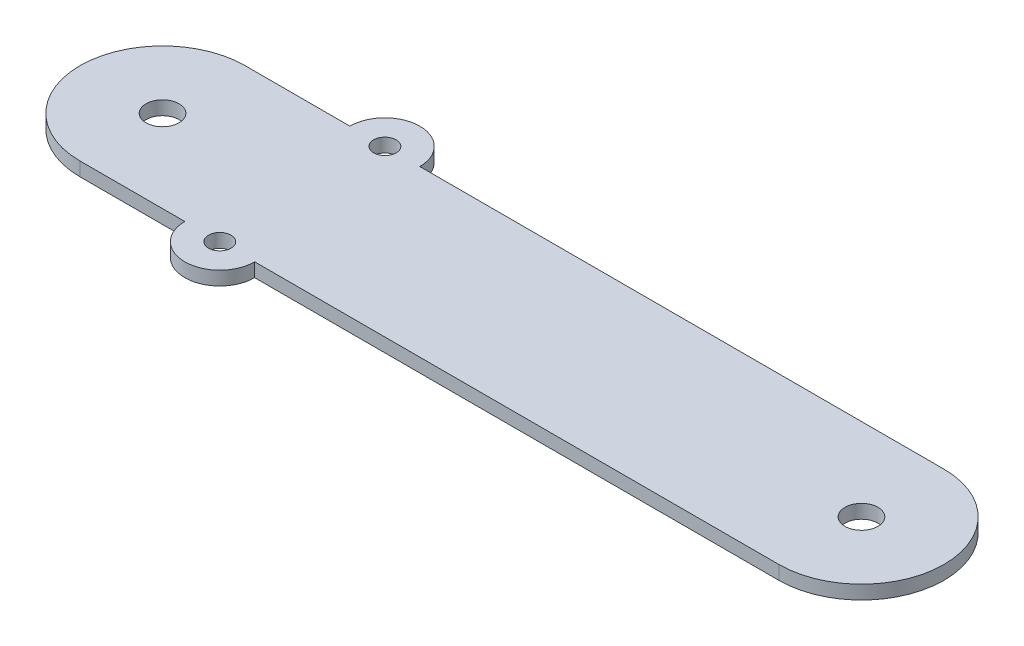
ISO-10303-21;
HEADER;
FILE_DESCRIPTION(('STEP AP214'),'2;1');
FILE_NAME('part.step','',(''),(''),'','','');
FILE_SCHEMA(('AUTOMOTIVE_DESIGN { 1 0 10303 214 1 1 1 1 }'));
ENDSEC;
DATA;
#1=APPLICATION_CONTEXT('core data for automotive mechanical design processes');
#2=APPLICATION_PROTOCOL_DEFINITION('international standard','automotive_design',2000,#1);
#3=PRODUCT_CONTEXT('',#1,'mechanical');
#4=PRODUCT('Part','Part','',(#3));
#5=PRODUCT_RELATED_PRODUCT_CATEGORY('part','',(#4));
#6=PRODUCT_DEFINITION_FORMATION('','',#4);
#7=PRODUCT_DEFINITION_CONTEXT('part definition',#1,'design');
#8=PRODUCT_DEFINITION('design','',#6,#7);
#9=PRODUCT_DEFINITION_SHAPE('','',#8);
#10=(LENGTH_UNIT() NAMED_UNIT(*) SI_UNIT(.MILLI.,.METRE.));
#11=(NAMED_UNIT(*) PLANE_ANGLE_UNIT() SI_UNIT($,.RADIAN.));
#12=(NAMED_UNIT(*) SI_UNIT($,.STERADIAN.) SOLID_ANGLE_UNIT());
#13=UNCERTAINTY_MEASURE_WITH_UNIT(LENGTH_MEASURE(1.E-05),#10,'distance_accuracy_value','');
#14=(GEOMETRIC_REPRESENTATION_CONTEXT(3) GLOBAL_UNCERTAINTY_ASSIGNED_CONTEXT((#13)) GLOBAL_UNIT_ASSIGNED_CONTEXT((#10,
#11,#12)) REPRESENTATION_CONTEXT('',''));
#15=CARTESIAN_POINT('',(0.,0.,0.));
#16=DIRECTION('',(0.,0.,1.));
#17=DIRECTION('',(1.,0.,0.));
#18=AXIS2_PLACEMENT_3D('',#15,#16,#17);
#19=CARTESIAN_POINT('',(-76.2,2.5,-30.));
#20=DIRECTION('',(0.,-1.,0.));
#21=DIRECTION('',(0.,0.,-1.));
#22=AXIS2_PLACEMENT_3D('',#19,#20,#21);
#23=CYLINDRICAL_SURFACE('',#22,12.7);
#24=CARTESIAN_POINT('',(-76.2,-2.5,-30.));
#25=DIRECTION('',(0.,1.,0.));
#26=DIRECTION('',(0.,0.,1.));
#27=AXIS2_PLACEMENT_3D('',#24,#25,#26);
#28=CIRCLE('',#27,12.7);
#29=CARTESIAN_POINT('',(-88.9,-2.5,-30.));
#30=VERTEX_POINT('',#29);
#31=CARTESIAN_POINT('',(-63.5,-2.5,-30.));
#32=VERTEX_POINT('',#31);
#33=EDGE_CURVE('E130',#30,#32,#28,.F.);
#34=ORIENTED_EDGE('',*,*,#33,.F.);
#35=DIRECTION('',(0.,-1.,0.));
#36=VECTOR('',#35,1.);
#37=CARTESIAN_POINT('',(-88.9,2.5,-30.));
#38=LINE('',#37,#36);
#39=CARTESIAN_POINT('',(-88.9,2.5,-30.));
#40=VERTEX_POINT('',#39);
#41=EDGE_CURVE('E11',#40,#30,#38,.T.);
#42=ORIENTED_EDGE('',*,*,#41,.F.);
#43=CARTESIAN_POINT('',(-76.2,2.5,-30.));
#44=DIRECTION('',(0.,1.,0.));
#45=DIRECTION('',(0.,0.,1.));
#46=AXIS2_PLACEMENT_3D('',#43,#44,#45);
#47=CIRCLE('',#46,12.7);
#48=CARTESIAN_POINT('',(-63.5,2.5,-30.));
#49=VERTEX_POINT('',#48);
#50=EDGE_CURVE('E170',#40,#49,#47,.F.);
#51=ORIENTED_EDGE('',*,*,#50,.T.);
#52=DIRECTION('',(0.,-1.,0.));
#53=VECTOR('',#52,1.);
#54=CARTESIAN_POINT('',(-63.5,2.5,-30.));
#55=LINE('',#54,#53);
#56=EDGE_CURVE('E51',#49,#32,#55,.T.);
#57=ORIENTED_EDGE('',*,*,#56,.T.);
#58=EDGE_LOOP('',(#34,#42,#51,#57));
#59=FACE_BOUND('',#58,.T.);
#60=ADVANCED_FACE('F35',(#59),#23,.T.);
#61=CARTESIAN_POINT('',(0.,2.5,-30.));
#62=DIRECTION('',(0.,0.,-1.));
#63=DIRECTION('',(-1.,0.,0.));
#64=AXIS2_PLACEMENT_3D('',#61,#62,#63);
#65=PLANE('',#64);
#66=DIRECTION('',(1.,0.,0.));
#67=VECTOR('',#66,1.);
#68=CARTESIAN_POINT('',(0.,-2.5,-30.));
#69=LINE('',#68,#67);
#70=CARTESIAN_POINT('',(-127.,-2.5,-30.));
#71=VERTEX_POINT('',#70);
#72=EDGE_CURVE('E132',#71,#30,#69,.T.);
#73=ORIENTED_EDGE('',*,*,#72,.F.);
#74=DIRECTION('',(0.,-1.,0.));
#75=VECTOR('',#74,1.);
#76=CARTESIAN_POINT('',(-127.,2.5,-30.));
#77=LINE('',#76,#75);
#78=CARTESIAN_POINT('',(-127.,2.5,-30.));
#79=VERTEX_POINT('',#78);
#80=EDGE_CURVE('E43',#79,#71,#77,.T.);
#81=ORIENTED_EDGE('',*,*,#80,.F.);
#82=DIRECTION('',(1.,0.,0.));
#83=VECTOR('',#82,1.);
#84=CARTESIAN_POINT('',(0.,2.5,-30.));
#85=LINE('',#84,#83);
#86=EDGE_CURVE('E127',#79,#40,#85,.T.);
#87=ORIENTED_EDGE('',*,*,#86,.T.);
#88=ORIENTED_EDGE('',*,*,#41,.T.);
#89=EDGE_LOOP('',(#73,#81,#87,#88));
#90=FACE_BOUND('',#89,.T.);
#91=ADVANCED_FACE('F167',(#90),#65,.T.);
#92=CARTESIAN_POINT('',(-127.,2.5,0.));
#93=DIRECTION('',(0.,-1.,0.));
#94=DIRECTION('',(0.,0.,-1.));
#95=AXIS2_PLACEMENT_3D('',#92,#93,#94);
#96=CYLINDRICAL_SURFACE('',#95,30.);
#97=CARTESIAN_POINT('',(-127.,-2.5,0.));
#98=DIRECTION('',(0.,1.,0.));
#99=DIRECTION('',(0.,0.,1.));
#100=AXIS2_PLACEMENT_3D('',#97,#98,#99);
#101=CIRCLE('',#100,30.);
#102=CARTESIAN_POINT('',(-127.,-2.5,30.));
#103=VERTEX_POINT('',#102);
#104=EDGE_CURVE('E136',#71,#103,#101,.T.);
#105=ORIENTED_EDGE('',*,*,#104,.T.);
#106=DIRECTION('',(0.,-1.,0.));
#107=VECTOR('',#106,1.);
#108=CARTESIAN_POINT('',(-127.,2.5,30.));
#109=LINE('',#108,#107);
#110=CARTESIAN_POINT('',(-127.,2.5,30.));
#111=VERTEX_POINT('',#110);
#112=EDGE_CURVE('E151',#111,#103,#109,.T.);
#113=ORIENTED_EDGE('',*,*,#112,.F.);
#114=CARTESIAN_POINT('',(-127.,2.5,0.));
#115=DIRECTION('',(0.,1.,0.));
#116=DIRECTION('',(0.,0.,1.));
#117=AXIS2_PLACEMENT_3D('',#114,#115,#116);
#118=CIRCLE('',#117,30.);
#119=EDGE_CURVE('E158',#79,#111,#118,.T.);
#120=ORIENTED_EDGE('',*,*,#119,.F.);
#121=ORIENTED_EDGE('',*,*,#80,.T.);
#122=EDGE_LOOP('',(#105,#113,#120,#121));
#123=FACE_BOUND('',#122,.T.);
#124=ADVANCED_FACE('F156',(#123),#96,.T.);
#125=CARTESIAN_POINT('',(0.,2.5,30.));
#126=DIRECTION('',(0.,0.,-1.));
#127=DIRECTION('',(-1.,0.,0.));
#128=AXIS2_PLACEMENT_3D('',#125,#126,#127);
#129=PLANE('',#128);
#130=DIRECTION('',(1.,0.,0.));
#131=VECTOR('',#130,1.);
#132=CARTESIAN_POINT('',(0.,-2.5,30.));
#133=LINE('',#132,#131);
#134=CARTESIAN_POINT('',(-88.9,-2.5,30.));
#135=VERTEX_POINT('',#134);
#136=EDGE_CURVE('E139',#103,#135,#133,.T.);
#137=ORIENTED_EDGE('',*,*,#136,.T.);
#138=DIRECTION('',(0.,-1.,0.));
#139=VECTOR('',#138,1.);
#140=CARTESIAN_POINT('',(-88.9,2.5,30.));
#141=LINE('',#140,#139);
#142=CARTESIAN_POINT('',(-88.9,2.5,30.));
#143=VERTEX_POINT('',#142);
#144=EDGE_CURVE('E148',#143,#135,#141,.T.);
#145=ORIENTED_EDGE('',*,*,#144,.F.);
#146=DIRECTION('',(1.,0.,0.));
#147=VECTOR('',#146,1.);
#148=CARTESIAN_POINT('',(0.,2.5,30.));
#149=LINE('',#148,#147);
#150=EDGE_CURVE('E113',#111,#143,#149,.T.);
#151=ORIENTED_EDGE('',*,*,#150,.F.);
#152=ORIENTED_EDGE('',*,*,#112,.T.);
#153=EDGE_LOOP('',(#137,#145,#151,#152));
#154=FACE_BOUND('',#153,.T.);
#155=ADVANCED_FACE('F178',(#154),#129,.F.);
#156=CARTESIAN_POINT('',(-76.2,2.5,30.));
#157=DIRECTION('',(0.,-1.,0.));
#158=DIRECTION('',(0.,0.,-1.));
#159=AXIS2_PLACEMENT_3D('',#156,#157,#158);
#160=CYLINDRICAL_SURFACE('',#159,12.7);
#161=CARTESIAN_POINT('',(-76.2,-2.5,30.));
#162=DIRECTION('',(0.,1.,0.));
#163=DIRECTION('',(0.,0.,1.));
#164=AXIS2_PLACEMENT_3D('',#161,#162,#163);
#165=CIRCLE('',#164,12.7);
#166=CARTESIAN_POINT('',(-63.5,-2.5,30.));
#167=VERTEX_POINT('',#166);
#168=EDGE_CURVE('E141',#135,#167,#165,.T.);
#169=ORIENTED_EDGE('',*,*,#168,.T.);
#170=DIRECTION('',(0.,-1.,0.));
#171=VECTOR('',#170,1.);
#172=CARTESIAN_POINT('',(-63.5,2.5,30.));
#173=LINE('',#172,#171);
#174=CARTESIAN_POINT('',(-63.5,2.5,30.));
#175=VERTEX_POINT('',#174);
#176=EDGE_CURVE('E121',#175,#167,#173,.T.);
#177=ORIENTED_EDGE('',*,*,#176,.F.);
#178=CARTESIAN_POINT('',(-76.2,2.5,30.));
#179=DIRECTION('',(0.,1.,0.));
#180=DIRECTION('',(0.,0.,1.));
#181=AXIS2_PLACEMENT_3D('',#178,#179,#180);
#182=CIRCLE('',#181,12.7);
#183=EDGE_CURVE('E108',#143,#175,#182,.T.);
#184=ORIENTED_EDGE('',*,*,#183,.F.);
#185=ORIENTED_EDGE('',*,*,#144,.T.);
#186=EDGE_LOOP('',(#169,#177,#184,#185));
#187=FACE_BOUND('',#186,.T.);
#188=ADVANCED_FACE('F180',(#187),#160,.T.);
#189=CARTESIAN_POINT('',(127.,-2.5,30.));
#190=VERTEX_POINT('',#189);
#191=EDGE_CURVE('E118',#167,#190,#133,.T.);
#192=ORIENTED_EDGE('',*,*,#191,.T.);
#193=DIRECTION('',(0.,-1.,0.));
#194=VECTOR('',#193,1.);
#195=CARTESIAN_POINT('',(127.,2.5,30.));
#196=LINE('',#195,#194);
#197=CARTESIAN_POINT('',(127.,2.5,30.));
#198=VERTEX_POINT('',#197);
#199=EDGE_CURVE('E115',#198,#190,#196,.T.);
#200=ORIENTED_EDGE('',*,*,#199,.F.);
#201=EDGE_CURVE('E101',#175,#198,#149,.T.);
#202=ORIENTED_EDGE('',*,*,#201,.F.);
#203=ORIENTED_EDGE('',*,*,#176,.T.);
#204=EDGE_LOOP('',(#192,#200,#202,#203));
#205=FACE_BOUND('',#204,.T.);
#206=ADVANCED_FACE('F116',(#205),#129,.F.);
#207=CARTESIAN_POINT('',(127.,2.5,0.));
#208=DIRECTION('',(0.,-1.,0.));
#209=DIRECTION('',(0.,0.,-1.));
#210=AXIS2_PLACEMENT_3D('',#207,#208,#209);
#211=CYLINDRICAL_SURFACE('',#210,30.);
#212=CARTESIAN_POINT('',(127.,-2.5,0.));
#213=DIRECTION('',(0.,1.,0.));
#214=DIRECTION('',(0.,0.,1.));
#215=AXIS2_PLACEMENT_3D('',#212,#213,#214);
#216=CIRCLE('',#215,30.);
#217=CARTESIAN_POINT('',(127.,-2.5,-30.));
#218=VERTEX_POINT('',#217);
#219=EDGE_CURVE('E143',#190,#218,#216,.T.);
#220=ORIENTED_EDGE('',*,*,#219,.T.);
#221=DIRECTION('',(0.,-1.,0.));
#222=VECTOR('',#221,1.);
#223=CARTESIAN_POINT('',(127.,2.5,-30.));
#224=LINE('',#223,#222);
#225=CARTESIAN_POINT('',(127.,2.5,-30.));
#226=VERTEX_POINT('',#225);
#227=EDGE_CURVE('E77',#226,#218,#224,.T.);
#228=ORIENTED_EDGE('',*,*,#227,.F.);
#229=CARTESIAN_POINT('',(127.,2.5,0.));
#230=DIRECTION('',(0.,1.,0.));
#231=DIRECTION('',(0.,0.,1.));
#232=AXIS2_PLACEMENT_3D('',#229,#230,#231);
#233=CIRCLE('',#232,30.);
#234=EDGE_CURVE('E106',#198,#226,#233,.T.);
#235=ORIENTED_EDGE('',*,*,#234,.F.);
#236=ORIENTED_EDGE('',*,*,#199,.T.);
#237=EDGE_LOOP('',(#220,#228,#235,#236));
#238=FACE_BOUND('',#237,.T.);
#239=ADVANCED_FACE('F123',(#238),#211,.T.);
#240=EDGE_CURVE('E137',#32,#218,#69,.T.);
#241=ORIENTED_EDGE('',*,*,#240,.F.);
#242=ORIENTED_EDGE('',*,*,#56,.F.);
#243=EDGE_CURVE('E124',#49,#226,#85,.T.);
#244=ORIENTED_EDGE('',*,*,#243,.T.);
#245=ORIENTED_EDGE('',*,*,#227,.T.);
#246=EDGE_LOOP('',(#241,#242,#244,#245));
#247=FACE_BOUND('',#246,.T.);
#248=ADVANCED_FACE('F169',(#247),#65,.T.);
#249=CARTESIAN_POINT('',(0.,2.5,0.));
#250=DIRECTION('',(0.,1.,0.));
#251=DIRECTION('',(0.,0.,1.));
#252=AXIS2_PLACEMENT_3D('',#249,#250,#251);
#253=PLANE('',#252);
#254=CARTESIAN_POINT('',(-76.2,2.5,-30.));
#255=DIRECTION('',(0.,1.,0.));
#256=DIRECTION('',(0.,0.,1.));
#257=AXIS2_PLACEMENT_3D('',#254,#255,#256);
#258=CIRCLE('',#257,4.10000000000001);
#259=CARTESIAN_POINT('',(-76.2,2.5,-25.9));
#260=VERTEX_POINT('',#259);
#261=EDGE_CURVE('E317',#260,#260,#258,.T.);
#262=ORIENTED_EDGE('',*,*,#261,.F.);
#263=EDGE_LOOP('',(#262));
#264=FACE_BOUND('',#263,.T.);
#265=CARTESIAN_POINT('',(-76.2,2.5,30.));
#266=DIRECTION('',(0.,1.,0.));
#267=DIRECTION('',(0.,0.,1.));
#268=AXIS2_PLACEMENT_3D('',#265,#266,#267);
#269=CIRCLE('',#268,4.10000000000001);
#270=CARTESIAN_POINT('',(-76.2,2.5,34.1));
#271=VERTEX_POINT('',#270);
#272=EDGE_CURVE('E319',#271,#271,#269,.T.);
#273=ORIENTED_EDGE('',*,*,#272,.F.);
#274=EDGE_LOOP('',(#273));
#275=FACE_BOUND('',#274,.T.);
#276=CARTESIAN_POINT('',(-127.,2.5,0.));
#277=DIRECTION('',(0.,1.,0.));
#278=DIRECTION('',(0.,0.,1.));
#279=AXIS2_PLACEMENT_3D('',#276,#277,#278);
#280=CIRCLE('',#279,6.00000000000001);
#281=CARTESIAN_POINT('',(-127.,2.5,6.00000000000001));
#282=VERTEX_POINT('',#281);
#283=EDGE_CURVE('E327',#282,#282,#280,.T.);
#284=ORIENTED_EDGE('',*,*,#283,.F.);
#285=EDGE_LOOP('',(#284));
#286=FACE_BOUND('',#285,.T.);
#287=CARTESIAN_POINT('',(127.,2.5,0.));
#288=DIRECTION('',(0.,1.,0.));
#289=DIRECTION('',(0.,0.,1.));
#290=AXIS2_PLACEMENT_3D('',#287,#288,#289);
#291=CIRCLE('',#290,6.00000000000001);
#292=CARTESIAN_POINT('',(127.,2.5,5.99999999999996));
#293=VERTEX_POINT('',#292);
#294=EDGE_CURVE('E332',#293,#293,#291,.T.);
#295=ORIENTED_EDGE('',*,*,#294,.F.);
#296=EDGE_LOOP('',(#295));
#297=FACE_BOUND('',#296,.T.);
#298=ORIENTED_EDGE('',*,*,#50,.F.);
#299=ORIENTED_EDGE('',*,*,#86,.F.);
#300=ORIENTED_EDGE('',*,*,#119,.T.);
#301=ORIENTED_EDGE('',*,*,#150,.T.);
#302=ORIENTED_EDGE('',*,*,#183,.T.);
#303=ORIENTED_EDGE('',*,*,#201,.T.);
#304=ORIENTED_EDGE('',*,*,#234,.T.);
#305=ORIENTED_EDGE('',*,*,#243,.F.);
#306=EDGE_LOOP('',(#298,#299,#300,#301,#302,#303,#304,#305));
#307=FACE_BOUND('',#306,.T.);
#308=ADVANCED_FACE('F103',(#264,#275,#286,#297,#307),#253,.T.);
#309=CARTESIAN_POINT('',(0.,-2.5,0.));
#310=DIRECTION('',(0.,1.,0.));
#311=DIRECTION('',(0.,0.,1.));
#312=AXIS2_PLACEMENT_3D('',#309,#310,#311);
#313=PLANE('',#312);
#314=CARTESIAN_POINT('',(-76.2,-2.5,-30.));
#315=DIRECTION('',(0.,1.,0.));
#316=DIRECTION('',(0.,0.,1.));
#317=AXIS2_PLACEMENT_3D('',#314,#315,#316);
#318=CIRCLE('',#317,4.1);
#319=CARTESIAN_POINT('',(-76.2,-2.5,-25.9));
#320=VERTEX_POINT('',#319);
#321=EDGE_CURVE('E314',#320,#320,#318,.T.);
#322=ORIENTED_EDGE('',*,*,#321,.T.);
#323=EDGE_LOOP('',(#322));
#324=FACE_BOUND('',#323,.T.);
#325=CARTESIAN_POINT('',(-76.2,-2.5,30.));
#326=DIRECTION('',(0.,1.,0.));
#327=DIRECTION('',(0.,0.,1.));
#328=AXIS2_PLACEMENT_3D('',#325,#326,#327);
#329=CIRCLE('',#328,4.1);
#330=CARTESIAN_POINT('',(-76.2,-2.5,34.1));
#331=VERTEX_POINT('',#330);
#332=EDGE_CURVE('E324',#331,#331,#329,.T.);
#333=ORIENTED_EDGE('',*,*,#332,.T.);
#334=EDGE_LOOP('',(#333));
#335=FACE_BOUND('',#334,.T.);
#336=CARTESIAN_POINT('',(-127.,-2.5,0.));
#337=DIRECTION('',(0.,1.,0.));
#338=DIRECTION('',(0.,0.,1.));
#339=AXIS2_PLACEMENT_3D('',#336,#337,#338);
#340=CIRCLE('',#339,6.00000000000001);
#341=CARTESIAN_POINT('',(-127.,-2.5,6.00000000000001));
#342=VERTEX_POINT('',#341);
#343=EDGE_CURVE('E330',#342,#342,#340,.T.);
#344=ORIENTED_EDGE('',*,*,#343,.T.);
#345=EDGE_LOOP('',(#344));
#346=FACE_BOUND('',#345,.T.);
#347=CARTESIAN_POINT('',(127.,-2.5,0.));
#348=DIRECTION('',(0.,1.,0.));
#349=DIRECTION('',(0.,0.,1.));
#350=AXIS2_PLACEMENT_3D('',#347,#348,#349);
#351=CIRCLE('',#350,6.00000000000001);
#352=CARTESIAN_POINT('',(127.,-2.5,5.99999999999996));
#353=VERTEX_POINT('',#352);
#354=EDGE_CURVE('E133',#353,#353,#351,.T.);
#355=ORIENTED_EDGE('',*,*,#354,.T.);
#356=EDGE_LOOP('',(#355));
#357=FACE_BOUND('',#356,.T.);
#358=ORIENTED_EDGE('',*,*,#33,.T.);
#359=ORIENTED_EDGE('',*,*,#240,.T.);
#360=ORIENTED_EDGE('',*,*,#219,.F.);
#361=ORIENTED_EDGE('',*,*,#191,.F.);
#362=ORIENTED_EDGE('',*,*,#168,.F.);
#363=ORIENTED_EDGE('',*,*,#136,.F.);
#364=ORIENTED_EDGE('',*,*,#104,.F.);
#365=ORIENTED_EDGE('',*,*,#72,.T.);
#366=EDGE_LOOP('',(#358,#359,#360,#361,#362,#363,#364,#365));
#367=FACE_BOUND('',#366,.T.);
#368=ADVANCED_FACE('F165',(#324,#335,#346,#357,#367),#313,.F.);
#369=CARTESIAN_POINT('',(127.,2.5,0.));
#370=DIRECTION('',(0.,1.,0.));
#371=DIRECTION('',(0.,0.,1.));
#372=AXIS2_PLACEMENT_3D('',#369,#370,#371);
#373=CYLINDRICAL_SURFACE('',#372,6.00000000000001);
#374=ORIENTED_EDGE('',*,*,#354,.F.);
#375=EDGE_LOOP('',(#374));
#376=FACE_BOUND('',#375,.T.);
#377=ORIENTED_EDGE('',*,*,#294,.T.);
#378=EDGE_LOOP('',(#377));
#379=FACE_BOUND('',#378,.T.);
#380=ADVANCED_FACE('F264',(#376,#379),#373,.F.);
#381=CARTESIAN_POINT('',(-127.,2.5,0.));
#382=DIRECTION('',(0.,1.,0.));
#383=DIRECTION('',(0.,0.,1.));
#384=AXIS2_PLACEMENT_3D('',#381,#382,#383);
#385=CYLINDRICAL_SURFACE('',#384,6.00000000000001);
#386=ORIENTED_EDGE('',*,*,#343,.F.);
#387=EDGE_LOOP('',(#386));
#388=FACE_BOUND('',#387,.T.);
#389=ORIENTED_EDGE('',*,*,#283,.T.);
#390=EDGE_LOOP('',(#389));
#391=FACE_BOUND('',#390,.T.);
#392=ADVANCED_FACE('F278',(#388,#391),#385,.F.);
#393=CARTESIAN_POINT('',(-76.2,2.5,30.));
#394=DIRECTION('',(0.,1.,0.));
#395=DIRECTION('',(0.,0.,1.));
#396=AXIS2_PLACEMENT_3D('',#393,#394,#395);
#397=CYLINDRICAL_SURFACE('',#396,4.1);
#398=ORIENTED_EDGE('',*,*,#332,.F.);
#399=EDGE_LOOP('',(#398));
#400=FACE_BOUND('',#399,.T.);
#401=ORIENTED_EDGE('',*,*,#272,.T.);
#402=EDGE_LOOP('',(#401));
#403=FACE_BOUND('',#402,.T.);
#404=ADVANCED_FACE('F286',(#400,#403),#397,.F.);
#405=CARTESIAN_POINT('',(-76.2,2.5,-30.));
#406=DIRECTION('',(0.,1.,0.));
#407=DIRECTION('',(0.,0.,1.));
#408=AXIS2_PLACEMENT_3D('',#405,#406,#407);
#409=CYLINDRICAL_SURFACE('',#408,4.1);
#410=ORIENTED_EDGE('',*,*,#321,.F.);
#411=EDGE_LOOP('',(#410));
#412=FACE_BOUND('',#411,.T.);
#413=ORIENTED_EDGE('',*,*,#261,.T.);
#414=EDGE_LOOP('',(#413));
#415=FACE_BOUND('',#414,.T.);
#416=ADVANCED_FACE('F294',(#412,#415),#409,.F.);
#417=CLOSED_SHELL('',(#60,#91,#124,#155,#188,#206,#239,#248,#308,#368,#380,#392,#404,#416));
#418=MANIFOLD_SOLID_BREP('B2',#417);
#419=ADVANCED_BREP_SHAPE_REPRESENTATION('',(#18,#418),#14);
#420=SHAPE_DEFINITION_REPRESENTATION(#9,#419);
ENDSEC;
END-ISO-10303-21;
